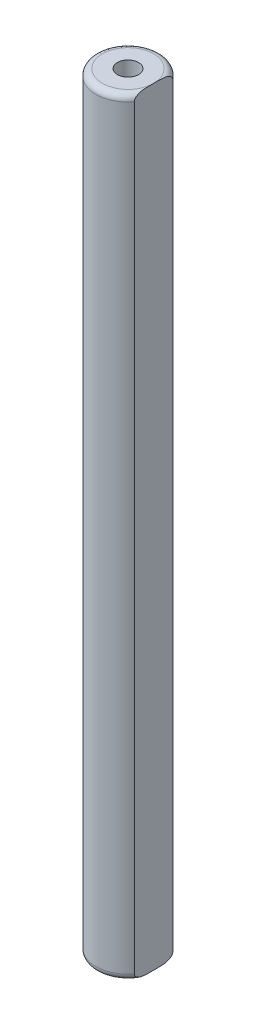
ISO-10303-21;
HEADER;
FILE_DESCRIPTION(('STEP AP214'),'2;1');
FILE_NAME('part.step','',(''),(''),'','','');
FILE_SCHEMA(('AUTOMOTIVE_DESIGN { 1 0 10303 214 1 1 1 1 }'));
ENDSEC;
DATA;
#1=APPLICATION_CONTEXT('core data for automotive mechanical design processes');
#2=APPLICATION_PROTOCOL_DEFINITION('international standard','automotive_design',2000,#1);
#3=PRODUCT_CONTEXT('',#1,'mechanical');
#4=PRODUCT('Part','Part','',(#3));
#5=PRODUCT_RELATED_PRODUCT_CATEGORY('part','',(#4));
#6=PRODUCT_DEFINITION_FORMATION('','',#4);
#7=PRODUCT_DEFINITION_CONTEXT('part definition',#1,'design');
#8=PRODUCT_DEFINITION('design','',#6,#7);
#9=PRODUCT_DEFINITION_SHAPE('','',#8);
#10=(LENGTH_UNIT() NAMED_UNIT(*) SI_UNIT(.MILLI.,.METRE.));
#11=(NAMED_UNIT(*) PLANE_ANGLE_UNIT() SI_UNIT($,.RADIAN.));
#12=(NAMED_UNIT(*) SI_UNIT($,.STERADIAN.) SOLID_ANGLE_UNIT());
#13=UNCERTAINTY_MEASURE_WITH_UNIT(LENGTH_MEASURE(1.E-05),#10,'distance_accuracy_value','');
#14=(GEOMETRIC_REPRESENTATION_CONTEXT(3) GLOBAL_UNCERTAINTY_ASSIGNED_CONTEXT((#13)) GLOBAL_UNIT_ASSIGNED_CONTEXT((#10,
#11,#12)) REPRESENTATION_CONTEXT('',''));
#15=CARTESIAN_POINT('',(0.,0.,0.));
#16=DIRECTION('',(0.,0.,1.));
#17=DIRECTION('',(1.,0.,0.));
#18=AXIS2_PLACEMENT_3D('',#15,#16,#17);
#19=CARTESIAN_POINT('',(0.,-30.,0.));
#20=DIRECTION('',(0.,-1.,0.));
#21=DIRECTION('',(0.,0.,1.));
#22=AXIS2_PLACEMENT_3D('',#19,#20,#21);
#23=PLANE('',#22);
#24=CARTESIAN_POINT('',(0.,-30.,0.));
#25=DIRECTION('',(0.,-1.,0.));
#26=DIRECTION('',(0.,0.,-1.));
#27=AXIS2_PLACEMENT_3D('',#24,#25,#26);
#28=CIRCLE('',#27,2.);
#29=CARTESIAN_POINT('',(2.,-30.,0.));
#30=VERTEX_POINT('',#29);
#31=EDGE_CURVE('E11',#30,#30,#28,.T.);
#32=ORIENTED_EDGE('',*,*,#31,.T.);
#33=EDGE_LOOP('',(#32));
#34=FACE_BOUND('',#33,.T.);
#35=CARTESIAN_POINT('',(0.,-30.,0.));
#36=DIRECTION('',(0.,1.,0.));
#37=DIRECTION('',(0.,0.,1.));
#38=AXIS2_PLACEMENT_3D('',#35,#36,#37);
#39=CIRCLE('',#38,0.825);
#40=CARTESIAN_POINT('',(0.,-30.,0.825));
#41=VERTEX_POINT('',#40);
#42=EDGE_CURVE('E133',#41,#41,#39,.T.);
#43=ORIENTED_EDGE('',*,*,#42,.T.);
#44=EDGE_LOOP('',(#43));
#45=FACE_BOUND('',#44,.T.);
#46=ADVANCED_FACE('F33',(#34,#45),#23,.T.);
#47=CARTESIAN_POINT('',(0.,30.,0.));
#48=DIRECTION('',(0.,-1.,0.));
#49=DIRECTION('',(0.,0.,-1.));
#50=AXIS2_PLACEMENT_3D('',#47,#48,#49);
#51=CYLINDRICAL_SURFACE('',#50,2.5);
#52=DIRECTION('',(0.,1.,0.));
#53=VECTOR('',#52,1.);
#54=CARTESIAN_POINT('',(2.,0.,-1.5));
#55=LINE('',#54,#53);
#56=CARTESIAN_POINT('',(2.,-29.5,-1.5));
#57=VERTEX_POINT('',#56);
#58=CARTESIAN_POINT('',(2.,29.5,-1.5));
#59=VERTEX_POINT('',#58);
#60=EDGE_CURVE('E80',#57,#59,#55,.T.);
#61=ORIENTED_EDGE('',*,*,#60,.F.);
#62=CARTESIAN_POINT('',(0.,-29.5,0.));
#63=DIRECTION('',(0.,-1.,0.));
#64=DIRECTION('',(0.,0.,-1.));
#65=AXIS2_PLACEMENT_3D('',#62,#63,#64);
#66=CIRCLE('',#65,2.5);
#67=CARTESIAN_POINT('',(2.,-29.5,1.5));
#68=VERTEX_POINT('',#67);
#69=EDGE_CURVE('E116',#57,#68,#66,.F.);
#70=ORIENTED_EDGE('',*,*,#69,.T.);
#71=DIRECTION('',(0.,1.,0.));
#72=VECTOR('',#71,1.);
#73=CARTESIAN_POINT('',(2.,0.,1.5));
#74=LINE('',#73,#72);
#75=CARTESIAN_POINT('',(2.,29.5,1.5));
#76=VERTEX_POINT('',#75);
#77=EDGE_CURVE('E121',#68,#76,#74,.T.);
#78=ORIENTED_EDGE('',*,*,#77,.T.);
#79=CARTESIAN_POINT('',(0.,29.5,0.));
#80=DIRECTION('',(0.,1.,0.));
#81=DIRECTION('',(0.,0.,1.));
#82=AXIS2_PLACEMENT_3D('',#79,#80,#81);
#83=CIRCLE('',#82,2.5);
#84=EDGE_CURVE('E75',#76,#59,#83,.F.);
#85=ORIENTED_EDGE('',*,*,#84,.T.);
#86=EDGE_LOOP('',(#61,#70,#78,#85));
#87=FACE_BOUND('',#86,.T.);
#88=ADVANCED_FACE('F152',(#87),#51,.T.);
#89=CARTESIAN_POINT('',(0.,30.,0.));
#90=DIRECTION('',(0.,1.,0.));
#91=DIRECTION('',(0.,0.,1.));
#92=AXIS2_PLACEMENT_3D('',#89,#90,#91);
#93=PLANE('',#92);
#94=CARTESIAN_POINT('',(0.,30.,0.));
#95=DIRECTION('',(0.,1.,0.));
#96=DIRECTION('',(0.,0.,1.));
#97=AXIS2_PLACEMENT_3D('',#94,#95,#96);
#98=CIRCLE('',#97,2.);
#99=CARTESIAN_POINT('',(2.,30.,0.));
#100=VERTEX_POINT('',#99);
#101=EDGE_CURVE('E73',#100,#100,#98,.T.);
#102=ORIENTED_EDGE('',*,*,#101,.T.);
#103=EDGE_LOOP('',(#102));
#104=FACE_BOUND('',#103,.T.);
#105=CARTESIAN_POINT('',(0.,30.,0.));
#106=DIRECTION('',(0.,1.,0.));
#107=DIRECTION('',(0.,0.,1.));
#108=AXIS2_PLACEMENT_3D('',#105,#106,#107);
#109=CIRCLE('',#108,0.825);
#110=CARTESIAN_POINT('',(0.,30.,0.825));
#111=VERTEX_POINT('',#110);
#112=EDGE_CURVE('E88',#111,#111,#109,.T.);
#113=ORIENTED_EDGE('',*,*,#112,.F.);
#114=EDGE_LOOP('',(#113));
#115=FACE_BOUND('',#114,.T.);
#116=ADVANCED_FACE('F83',(#104,#115),#93,.T.);
#117=CARTESIAN_POINT('',(0.,25.,0.));
#118=DIRECTION('',(0.,1.,0.));
#119=DIRECTION('',(0.,0.,1.));
#120=AXIS2_PLACEMENT_3D('',#117,#118,#119);
#121=CYLINDRICAL_SURFACE('',#120,0.825);
#122=CARTESIAN_POINT('',(0.,25.,0.));
#123=DIRECTION('',(0.,1.,0.));
#124=DIRECTION('',(0.,0.,1.));
#125=AXIS2_PLACEMENT_3D('',#122,#123,#124);
#126=CIRCLE('',#125,0.825);
#127=CARTESIAN_POINT('',(0.,25.,0.825));
#128=VERTEX_POINT('',#127);
#129=EDGE_CURVE('E85',#128,#128,#126,.T.);
#130=ORIENTED_EDGE('',*,*,#129,.F.);
#131=EDGE_LOOP('',(#130));
#132=FACE_BOUND('',#131,.T.);
#133=ORIENTED_EDGE('',*,*,#112,.T.);
#134=EDGE_LOOP('',(#133));
#135=FACE_BOUND('',#134,.T.);
#136=ADVANCED_FACE('F159',(#132,#135),#121,.F.);
#137=CARTESIAN_POINT('',(0.,25.,0.));
#138=DIRECTION('',(0.,1.,0.));
#139=DIRECTION('',(0.,0.,1.));
#140=AXIS2_PLACEMENT_3D('',#137,#138,#139);
#141=PLANE('',#140);
#142=ORIENTED_EDGE('',*,*,#129,.T.);
#143=EDGE_LOOP('',(#142));
#144=FACE_BOUND('',#143,.T.);
#145=ADVANCED_FACE('F105',(#144),#141,.T.);
#146=CARTESIAN_POINT('',(2.,0.,-1.5));
#147=DIRECTION('',(-1.,0.,0.));
#148=DIRECTION('',(0.,0.,1.));
#149=AXIS2_PLACEMENT_3D('',#146,#147,#148);
#150=PLANE('',#149);
#151=ORIENTED_EDGE('',*,*,#77,.F.);
#152=CARTESIAN_POINT('',(2.,-29.5,1.5));
#153=CARTESIAN_POINT('',(2.,-29.5200065150284,1.50005508764519));
#154=CARTESIAN_POINT('',(2.,-29.5399505223803,1.49800297503596));
#155=CARTESIAN_POINT('',(2.,-29.5788908622129,1.49017103135305));
#156=CARTESIAN_POINT('',(2.,-29.597894786355,1.48442943896433));
#157=CARTESIAN_POINT('',(2.,-29.6345007170815,1.46971395516312));
#158=CARTESIAN_POINT('',(2.,-29.6521074472319,1.46075157527048));
#159=CARTESIAN_POINT('',(2.,-29.6857418270518,1.44018960181346));
#160=CARTESIAN_POINT('',(2.,-29.7017650844176,1.42858295243753));
#161=CARTESIAN_POINT('',(2.,-29.7389337995344,1.39760924057378));
#162=CARTESIAN_POINT('',(2.,-29.7591275913188,1.37710380043444));
#163=CARTESIAN_POINT('',(2.,-29.7960193785026,1.3332153788633));
#164=CARTESIAN_POINT('',(2.,-29.8127135559447,1.30982929844171));
#165=CARTESIAN_POINT('',(2.,-29.8525266059827,1.24588475655888));
#166=CARTESIAN_POINT('',(2.,-29.8731102761167,1.20375339504331));
#167=CARTESIAN_POINT('',(2.,-29.8992657628372,1.13857481760512));
#168=CARTESIAN_POINT('',(2.,-29.9072271665565,1.11639476146753));
#169=CARTESIAN_POINT('',(2.,-29.9217347834849,1.07158652733004));
#170=CARTESIAN_POINT('',(2.,-29.9282820228324,1.04895868735181));
#171=CARTESIAN_POINT('',(2.,-29.9454775535542,0.982989447767375));
#172=CARTESIAN_POINT('',(2.,-29.9545494991958,0.939240813702869));
#173=CARTESIAN_POINT('',(2.,-29.9694389319571,0.851180575194751));
#174=CARTESIAN_POINT('',(2.,-29.9752529100803,0.806868416119318));
#175=CARTESIAN_POINT('',(2.,-29.9845404183726,0.717748873858498));
#176=CARTESIAN_POINT('',(2.,-29.9880000262617,0.672940110398229));
#177=CARTESIAN_POINT('',(2.,-29.993276064899,0.583224127429996));
#178=CARTESIAN_POINT('',(2.,-29.9950920982067,0.53831688673903));
#179=CARTESIAN_POINT('',(2.,-29.9975884411658,0.45202717013826));
#180=CARTESIAN_POINT('',(2.,-29.998347176557,0.410646661478022));
#181=CARTESIAN_POINT('',(2.,-29.9993649293624,0.327877214900453));
#182=CARTESIAN_POINT('',(2.,-29.9996239046374,0.286488276566583));
#183=CARTESIAN_POINT('',(2.,-29.9999262759538,0.204245986253956));
#184=CARTESIAN_POINT('',(2.,-29.9999724201265,0.163392638975685));
#185=CARTESIAN_POINT('',(2.,-29.9999994454164,0.0816928216893278));
#186=CARTESIAN_POINT('',(2.,-29.9999803376138,0.0408463516913624));
#187=CARTESIAN_POINT('',(2.,-30.,0.));
#188=B_SPLINE_CURVE_WITH_KNOTS('',3,(#152,#153,#154,#155,#156,#157,#158,#159,#160,#161,#162,
#163,#164,#165,#166,#167,#168,#169,#170,#171,#172,#173,#174,#175,#176,#177,#178,#179,#180,#181,
#182,#183,#184,#185,#186,#187),.UNSPECIFIED.,.F.,.F.,(4,2,2,2,2,2,2,2,2,2,2,2,2,2,2,2,2,4),(0.,
0.0598154823382512,0.119020807803603,0.178016596524446,0.237171689151975,0.323022405322561,
0.408966299732605,0.548800102010773,0.619474466309536,0.690097374684527,0.823948961414436,
0.957944437366599,1.09272554990601,1.2275392458054,1.35169671337948,1.47586464927862,
1.59842472260636,1.72096398530663),.UNSPECIFIED.);
#189=EDGE_CURVE('E42',#68,#30,#188,.T.);
#190=ORIENTED_EDGE('',*,*,#189,.T.);
#191=CARTESIAN_POINT('',(2.,-30.,0.));
#192=CARTESIAN_POINT('',(2.,-29.999980484284,-0.0407626231076289));
#193=CARTESIAN_POINT('',(2.,-29.9999994433899,-0.0815253750922564));
#194=CARTESIAN_POINT('',(2.,-29.9999726519699,-0.163057529759021));
#195=CARTESIAN_POINT('',(2.,-29.9999268907924,-0.203826932431489));
#196=CARTESIAN_POINT('',(2.,-29.9996272394696,-0.285823216792328));
#197=CARTESIAN_POINT('',(2.,-29.9993710177251,-0.327050094241002));
#198=CARTESIAN_POINT('',(2.,-29.9983653267444,-0.409495794992682));
#199=CARTESIAN_POINT('',(2.,-29.9976158970779,-0.450714618676486));
#200=CARTESIAN_POINT('',(2.,-29.9952076449429,-0.534687159846425));
#201=CARTESIAN_POINT('',(2.,-29.9935155371863,-0.577440036322864));
#202=CARTESIAN_POINT('',(2.,-29.9886762279352,-0.662861842446352));
#203=CARTESIAN_POINT('',(2.,-29.9855293281928,-0.7055307876601));
#204=CARTESIAN_POINT('',(2.,-29.9771629448661,-0.790467964812874));
#205=CARTESIAN_POINT('',(2.,-29.9719534285849,-0.832737137282494));
#206=CARTESIAN_POINT('',(2.,-29.9587065375739,-0.916821134882456));
#207=CARTESIAN_POINT('',(2.,-29.9506717348776,-0.958636337716516));
#208=CARTESIAN_POINT('',(2.,-29.9368499282799,-1.01633423815903));
#209=CARTESIAN_POINT('',(2.,-29.9326447414506,-1.0325980627166));
#210=CARTESIAN_POINT('',(2.,-29.9235803939948,-1.06494846149724));
#211=CARTESIAN_POINT('',(2.,-29.9187209867408,-1.08103496638818));
#212=CARTESIAN_POINT('',(2.,-29.9030766101654,-1.12889043811801));
#213=CARTESIAN_POINT('',(2.,-29.8912104355907,-1.16032087149606));
#214=CARTESIAN_POINT('',(2.,-29.8638471087185,-1.22193787642586));
#215=CARTESIAN_POINT('',(2.,-29.8483172442343,-1.25211017751241));
#216=CARTESIAN_POINT('',(2.,-29.8129711649222,-1.30987180248264));
#217=CARTESIAN_POINT('',(2.,-29.7931618343013,-1.33746517402654));
#218=CARTESIAN_POINT('',(2.,-29.7563229296638,-1.37963467843693));
#219=CARTESIAN_POINT('',(2.,-29.740685118637,-1.39542133682361));
#220=CARTESIAN_POINT('',(2.,-29.7072261082969,-1.4245077100884));
#221=CARTESIAN_POINT('',(2.,-29.6894069701865,-1.43780974319198));
#222=CARTESIAN_POINT('',(2.,-29.6545634610992,-1.45935751669131));
#223=CARTESIAN_POINT('',(2.,-29.637825568107,-1.46806350146973));
#224=CARTESIAN_POINT('',(2.,-29.6031430315798,-1.48256312102217));
#225=CARTESIAN_POINT('',(2.,-29.5852009877708,-1.48836281472543));
#226=CARTESIAN_POINT('',(2.,-29.5559337018007,-1.49497096281988));
#227=CARTESIAN_POINT('',(2.,-29.5448421897842,-1.49684839330713));
#228=CARTESIAN_POINT('',(2.,-29.5225033908703,-1.49936626406293));
#229=CARTESIAN_POINT('',(2.,-29.5112558958349,-1.5000048503837));
#230=CARTESIAN_POINT('',(2.,-29.5,-1.5));
#231=B_SPLINE_CURVE_WITH_KNOTS('',3,(#191,#192,#193,#194,#195,#196,#197,#198,#199,#200,#201,
#202,#203,#204,#205,#206,#207,#208,#209,#210,#211,#212,#213,#214,#215,#216,#217,#218,#219,#220,
#221,#222,#223,#224,#225,#226,#227,#228,#229,#230),.UNSPECIFIED.,.F.,.F.,(4,2,2,2,2,2,2,2,2,2,2,
2,2,2,2,2,2,2,2,4),(0.,0.122288098502134,0.244596325308749,0.368278121933788,0.491949996900832,
0.620293921253729,0.748611236515071,0.876315899810973,1.00390460532892,1.05428854590096,
1.10469153363842,1.20529649885782,1.30683621704436,1.4082137927434,1.47468160162245,
1.54108708094665,1.5974625296124,1.65371995469663,1.68740390926937,1.72113823358775),.UNSPECIFIED.);
#232=EDGE_CURVE('E52',#30,#57,#231,.T.);
#233=ORIENTED_EDGE('',*,*,#232,.T.);
#234=ORIENTED_EDGE('',*,*,#60,.T.);
#235=CARTESIAN_POINT('',(2.,29.5,-1.5));
#236=CARTESIAN_POINT('',(2.,29.5200065150284,-1.50005508764519));
#237=CARTESIAN_POINT('',(2.,29.5399505223803,-1.49800297503596));
#238=CARTESIAN_POINT('',(2.,29.5788908622129,-1.49017103135305));
#239=CARTESIAN_POINT('',(2.,29.597894786355,-1.48442943896433));
#240=CARTESIAN_POINT('',(2.,29.6345007170815,-1.46971395516312));
#241=CARTESIAN_POINT('',(2.,29.6521074472319,-1.46075157527048));
#242=CARTESIAN_POINT('',(2.,29.6857418270518,-1.44018960181346));
#243=CARTESIAN_POINT('',(2.,29.7017650844176,-1.42858295243753));
#244=CARTESIAN_POINT('',(2.,29.7389337995344,-1.39760924057378));
#245=CARTESIAN_POINT('',(2.,29.7591275913188,-1.37710380043444));
#246=CARTESIAN_POINT('',(2.,29.7960193785026,-1.3332153788633));
#247=CARTESIAN_POINT('',(2.,29.8127135559447,-1.30982929844171));
#248=CARTESIAN_POINT('',(2.,29.8525266059827,-1.24588475655888));
#249=CARTESIAN_POINT('',(2.,29.8731102761167,-1.20375339504331));
#250=CARTESIAN_POINT('',(2.,29.8992657628372,-1.13857481760512));
#251=CARTESIAN_POINT('',(2.,29.9072271665565,-1.11639476146753));
#252=CARTESIAN_POINT('',(2.,29.9217347834849,-1.07158652733004));
#253=CARTESIAN_POINT('',(2.,29.9282820228324,-1.04895868735181));
#254=CARTESIAN_POINT('',(2.,29.9454775535542,-0.982989447767375));
#255=CARTESIAN_POINT('',(2.,29.9545494991958,-0.939240813702869));
#256=CARTESIAN_POINT('',(2.,29.9694389319571,-0.851180575194751));
#257=CARTESIAN_POINT('',(2.,29.9752529100803,-0.806868416119318));
#258=CARTESIAN_POINT('',(2.,29.9845404183726,-0.717748873858498));
#259=CARTESIAN_POINT('',(2.,29.9880000262617,-0.672940110398229));
#260=CARTESIAN_POINT('',(2.,29.993276064899,-0.583224127429996));
#261=CARTESIAN_POINT('',(2.,29.9950920982067,-0.53831688673903));
#262=CARTESIAN_POINT('',(2.,29.9975884411658,-0.45202717013826));
#263=CARTESIAN_POINT('',(2.,29.998347176557,-0.410646661478022));
#264=CARTESIAN_POINT('',(2.,29.9993649293624,-0.327877214900453));
#265=CARTESIAN_POINT('',(2.,29.9996239046374,-0.286488276566583));
#266=CARTESIAN_POINT('',(2.,29.9999262759538,-0.204245986253956));
#267=CARTESIAN_POINT('',(2.,29.9999724201265,-0.163392638975685));
#268=CARTESIAN_POINT('',(2.,29.9999994454164,-0.0816928216893278));
#269=CARTESIAN_POINT('',(2.,29.9999803376138,-0.0408463516913624));
#270=CARTESIAN_POINT('',(2.,30.,0.));
#271=B_SPLINE_CURVE_WITH_KNOTS('',3,(#235,#236,#237,#238,#239,#240,#241,#242,#243,#244,#245,
#246,#247,#248,#249,#250,#251,#252,#253,#254,#255,#256,#257,#258,#259,#260,#261,#262,#263,#264,
#265,#266,#267,#268,#269,#270),.UNSPECIFIED.,.F.,.F.,(4,2,2,2,2,2,2,2,2,2,2,2,2,2,2,2,2,4),(0.,
0.0598154823382512,0.119020807803603,0.178016596524446,0.237171689151975,0.323022405322561,
0.408966299732605,0.548800102010773,0.619474466309536,0.690097374684527,0.823948961414436,
0.957944437366599,1.09272554990601,1.2275392458054,1.35169671337948,1.47586464927862,
1.59842472260636,1.72096398530663),.UNSPECIFIED.);
#272=EDGE_CURVE('E77',#59,#100,#271,.T.);
#273=ORIENTED_EDGE('',*,*,#272,.T.);
#274=CARTESIAN_POINT('',(2.,30.,0.));
#275=CARTESIAN_POINT('',(2.,29.999980484284,0.0407626231076289));
#276=CARTESIAN_POINT('',(2.,29.9999994433899,0.0815253750922564));
#277=CARTESIAN_POINT('',(2.,29.9999726519699,0.163057529759021));
#278=CARTESIAN_POINT('',(2.,29.9999268907924,0.203826932431489));
#279=CARTESIAN_POINT('',(2.,29.9996272394696,0.285823216792328));
#280=CARTESIAN_POINT('',(2.,29.9993710177251,0.327050094241002));
#281=CARTESIAN_POINT('',(2.,29.9983653267444,0.409495794992682));
#282=CARTESIAN_POINT('',(2.,29.9976158970779,0.450714618676486));
#283=CARTESIAN_POINT('',(2.,29.9952076449429,0.534687159846425));
#284=CARTESIAN_POINT('',(2.,29.9935155371863,0.577440036322864));
#285=CARTESIAN_POINT('',(2.,29.9886762279352,0.662861842446352));
#286=CARTESIAN_POINT('',(2.,29.9855293281928,0.7055307876601));
#287=CARTESIAN_POINT('',(2.,29.9771629448661,0.790467964812874));
#288=CARTESIAN_POINT('',(2.,29.9719534285849,0.832737137282494));
#289=CARTESIAN_POINT('',(2.,29.9587065375739,0.916821134882456));
#290=CARTESIAN_POINT('',(2.,29.9506717348776,0.958636337716516));
#291=CARTESIAN_POINT('',(2.,29.9368499282799,1.01633423815903));
#292=CARTESIAN_POINT('',(2.,29.9326447414506,1.0325980627166));
#293=CARTESIAN_POINT('',(2.,29.9235803939948,1.06494846149724));
#294=CARTESIAN_POINT('',(2.,29.9187209867408,1.08103496638818));
#295=CARTESIAN_POINT('',(2.,29.9030766101654,1.12889043811801));
#296=CARTESIAN_POINT('',(2.,29.8912104355907,1.16032087149606));
#297=CARTESIAN_POINT('',(2.,29.8638471087185,1.22193787642586));
#298=CARTESIAN_POINT('',(2.,29.8483172442343,1.25211017751241));
#299=CARTESIAN_POINT('',(2.,29.8129711649222,1.30987180248264));
#300=CARTESIAN_POINT('',(2.,29.7931618343013,1.33746517402654));
#301=CARTESIAN_POINT('',(2.,29.7563229296638,1.37963467843693));
#302=CARTESIAN_POINT('',(2.,29.740685118637,1.39542133682361));
#303=CARTESIAN_POINT('',(2.,29.7072261082969,1.4245077100884));
#304=CARTESIAN_POINT('',(2.,29.6894069701865,1.43780974319198));
#305=CARTESIAN_POINT('',(2.,29.6545634610992,1.45935751669131));
#306=CARTESIAN_POINT('',(2.,29.637825568107,1.46806350146973));
#307=CARTESIAN_POINT('',(2.,29.6031430315798,1.48256312102217));
#308=CARTESIAN_POINT('',(2.,29.5852009877708,1.48836281472543));
#309=CARTESIAN_POINT('',(2.,29.5559337018007,1.49497096281988));
#310=CARTESIAN_POINT('',(2.,29.5448421897842,1.49684839330713));
#311=CARTESIAN_POINT('',(2.,29.5225033908703,1.49936626406293));
#312=CARTESIAN_POINT('',(2.,29.5112558958349,1.5000048503837));
#313=CARTESIAN_POINT('',(2.,29.5,1.5));
#314=B_SPLINE_CURVE_WITH_KNOTS('',3,(#274,#275,#276,#277,#278,#279,#280,#281,#282,#283,#284,
#285,#286,#287,#288,#289,#290,#291,#292,#293,#294,#295,#296,#297,#298,#299,#300,#301,#302,#303,
#304,#305,#306,#307,#308,#309,#310,#311,#312,#313),.UNSPECIFIED.,.F.,.F.,(4,2,2,2,2,2,2,2,2,2,2,
2,2,2,2,2,2,2,2,4),(0.,0.122288098502134,0.244596325308749,0.368278121933788,0.491949996900832,
0.620293921253729,0.748611236515071,0.876315899810973,1.00390460532892,1.05428854590096,
1.10469153363842,1.20529649885782,1.30683621704436,1.4082137927434,1.47468160162245,
1.54108708094665,1.5974625296124,1.65371995469663,1.68740390926937,1.72113823358775),.UNSPECIFIED.);
#315=EDGE_CURVE('E68',#100,#76,#314,.T.);
#316=ORIENTED_EDGE('',*,*,#315,.T.);
#317=EDGE_LOOP('',(#151,#190,#233,#234,#273,#316));
#318=FACE_BOUND('',#317,.T.);
#319=ADVANCED_FACE('F79',(#318),#150,.F.);
#320=CARTESIAN_POINT('',(0.,29.5,0.));
#321=DIRECTION('',(0.,1.,0.));
#322=DIRECTION('',(0.,0.,1.));
#323=AXIS2_PLACEMENT_3D('',#320,#321,#322);
#324=TOROIDAL_SURFACE('',#323,2.,0.5);
#325=ORIENTED_EDGE('',*,*,#272,.F.);
#326=ORIENTED_EDGE('',*,*,#84,.F.);
#327=ORIENTED_EDGE('',*,*,#315,.F.);
#328=ORIENTED_EDGE('',*,*,#101,.F.);
#329=EDGE_LOOP('',(#325,#326,#327,#328));
#330=FACE_BOUND('',#329,.T.);
#331=ADVANCED_FACE('F71',(#330),#324,.T.);
#332=CARTESIAN_POINT('',(0.,-25.,0.));
#333=DIRECTION('',(0.,-1.,0.));
#334=DIRECTION('',(0.,0.,-1.));
#335=AXIS2_PLACEMENT_3D('',#332,#333,#334);
#336=CYLINDRICAL_SURFACE('',#335,0.825);
#337=CARTESIAN_POINT('',(0.,-25.,0.));
#338=DIRECTION('',(0.,1.,0.));
#339=DIRECTION('',(0.,0.,1.));
#340=AXIS2_PLACEMENT_3D('',#337,#338,#339);
#341=CIRCLE('',#340,0.825);
#342=CARTESIAN_POINT('',(0.,-25.,0.825));
#343=VERTEX_POINT('',#342);
#344=EDGE_CURVE('E131',#343,#343,#341,.T.);
#345=ORIENTED_EDGE('',*,*,#344,.T.);
#346=EDGE_LOOP('',(#345));
#347=FACE_BOUND('',#346,.T.);
#348=ORIENTED_EDGE('',*,*,#42,.F.);
#349=EDGE_LOOP('',(#348));
#350=FACE_BOUND('',#349,.T.);
#351=ADVANCED_FACE('F142',(#347,#350),#336,.F.);
#352=CARTESIAN_POINT('',(0.,-25.,0.));
#353=DIRECTION('',(0.,-1.,0.));
#354=DIRECTION('',(0.,0.,1.));
#355=AXIS2_PLACEMENT_3D('',#352,#353,#354);
#356=PLANE('',#355);
#357=ORIENTED_EDGE('',*,*,#344,.F.);
#358=EDGE_LOOP('',(#357));
#359=FACE_BOUND('',#358,.T.);
#360=ADVANCED_FACE('F144',(#359),#356,.T.);
#361=CARTESIAN_POINT('',(0.,-29.5,0.));
#362=DIRECTION('',(0.,-1.,0.));
#363=DIRECTION('',(0.,0.,-1.));
#364=AXIS2_PLACEMENT_3D('',#361,#362,#363);
#365=TOROIDAL_SURFACE('',#364,2.,0.5);
#366=ORIENTED_EDGE('',*,*,#232,.F.);
#367=ORIENTED_EDGE('',*,*,#31,.F.);
#368=ORIENTED_EDGE('',*,*,#189,.F.);
#369=ORIENTED_EDGE('',*,*,#69,.F.);
#370=EDGE_LOOP('',(#366,#367,#368,#369));
#371=FACE_BOUND('',#370,.T.);
#372=ADVANCED_FACE('F35',(#371),#365,.T.);
#373=CLOSED_SHELL('',(#46,#88,#116,#136,#145,#319,#331,#351,#360,#372));
#374=MANIFOLD_SOLID_BREP('B2',#373);
#375=ADVANCED_BREP_SHAPE_REPRESENTATION('',(#18,#374),#14);
#376=SHAPE_DEFINITION_REPRESENTATION(#9,#375);
ENDSEC;
END-ISO-10303-21;
